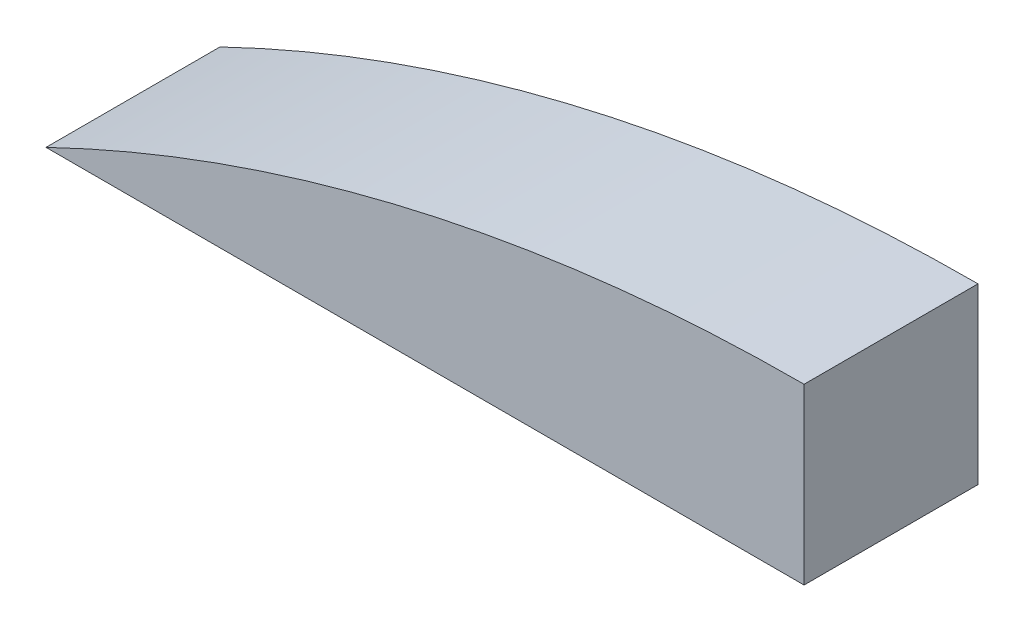
ISO-10303-21;
HEADER;
FILE_DESCRIPTION(('STEP AP214'),'2;1');
FILE_NAME('part.step','',(''),(''),'','','');
FILE_SCHEMA(('AUTOMOTIVE_DESIGN { 1 0 10303 214 1 1 1 1 }'));
ENDSEC;
DATA;
#1=APPLICATION_CONTEXT('core data for automotive mechanical design processes');
#2=APPLICATION_PROTOCOL_DEFINITION('international standard','automotive_design',2000,#1);
#3=PRODUCT_CONTEXT('',#1,'mechanical');
#4=PRODUCT('Part','Part','',(#3));
#5=PRODUCT_RELATED_PRODUCT_CATEGORY('part','',(#4));
#6=PRODUCT_DEFINITION_FORMATION('','',#4);
#7=PRODUCT_DEFINITION_CONTEXT('part definition',#1,'design');
#8=PRODUCT_DEFINITION('design','',#6,#7);
#9=PRODUCT_DEFINITION_SHAPE('','',#8);
#10=(LENGTH_UNIT() NAMED_UNIT(*) SI_UNIT(.MILLI.,.METRE.));
#11=(NAMED_UNIT(*) PLANE_ANGLE_UNIT() SI_UNIT($,.RADIAN.));
#12=(NAMED_UNIT(*) SI_UNIT($,.STERADIAN.) SOLID_ANGLE_UNIT());
#13=UNCERTAINTY_MEASURE_WITH_UNIT(LENGTH_MEASURE(1.E-05),#10,'distance_accuracy_value','');
#14=(GEOMETRIC_REPRESENTATION_CONTEXT(3) GLOBAL_UNCERTAINTY_ASSIGNED_CONTEXT((#13)) GLOBAL_UNIT_ASSIGNED_CONTEXT((#10,
#11,#12)) REPRESENTATION_CONTEXT('',''));
#15=CARTESIAN_POINT('',(0.,0.,0.));
#16=DIRECTION('',(0.,0.,1.));
#17=DIRECTION('',(1.,0.,0.));
#18=AXIS2_PLACEMENT_3D('',#15,#16,#17);
#19=CARTESIAN_POINT('',(0.,45.,0.));
#20=DIRECTION('',(0.,-1.,0.));
#21=DIRECTION('',(0.,0.,-1.));
#22=AXIS2_PLACEMENT_3D('',#19,#20,#21);
#23=PLANE('',#22);
#24=DIRECTION('',(1.,0.,0.));
#25=VECTOR('',#24,1.);
#26=CARTESIAN_POINT('',(597.266258042068,45.,5.));
#27=LINE('',#26,#25);
#28=CARTESIAN_POINT('',(-524.528236675635,45.,5.));
#29=VERTEX_POINT('',#28);
#30=CARTESIAN_POINT('',(-502.733741957931,45.,5.));
#31=VERTEX_POINT('',#30);
#32=EDGE_CURVE('E78',#29,#31,#27,.T.);
#33=ORIENTED_EDGE('',*,*,#32,.F.);
#34=DIRECTION('',(0.,0.,-1.));
#35=VECTOR('',#34,1.);
#36=CARTESIAN_POINT('',(-524.528236675635,45.,80.));
#37=LINE('',#36,#35);
#38=CARTESIAN_POINT('',(-524.528236675635,45.,0.));
#39=VERTEX_POINT('',#38);
#40=EDGE_CURVE('E37',#29,#39,#37,.T.);
#41=ORIENTED_EDGE('',*,*,#40,.T.);
#42=DIRECTION('',(1.,0.,0.));
#43=VECTOR('',#42,1.);
#44=CARTESIAN_POINT('',(-502.733741957931,45.,0.));
#45=LINE('',#44,#43);
#46=CARTESIAN_POINT('',(-502.733741957931,45.,0.));
#47=VERTEX_POINT('',#46);
#48=EDGE_CURVE('E88',#39,#47,#45,.T.);
#49=ORIENTED_EDGE('',*,*,#48,.T.);
#50=DIRECTION('',(0.,0.,1.));
#51=VECTOR('',#50,1.);
#52=CARTESIAN_POINT('',(-502.733741957931,45.,0.));
#53=LINE('',#52,#51);
#54=EDGE_CURVE('E11',#47,#31,#53,.T.);
#55=ORIENTED_EDGE('',*,*,#54,.T.);
#56=EDGE_LOOP('',(#33,#41,#49,#55));
#57=FACE_BOUND('',#56,.T.);
#58=ADVANCED_FACE('F34',(#57),#23,.T.);
#59=CARTESIAN_POINT('',(597.266258042068,-45.,5.));
#60=DIRECTION('',(0.,0.,1.));
#61=DIRECTION('',(1.,0.,0.));
#62=AXIS2_PLACEMENT_3D('',#59,#60,#61);
#63=PLANE('',#62);
#64=CARTESIAN_POINT('',(-502.733741957931,0.,5.));
#65=DIRECTION('',(0.,0.,1.));
#66=DIRECTION('',(1.,0.,0.));
#67=AXIS2_PLACEMENT_3D('',#64,#65,#66);
#68=CIRCLE('',#67,50.);
#69=CARTESIAN_POINT('',(-502.733741957931,50.,5.));
#70=VERTEX_POINT('',#69);
#71=EDGE_CURVE('E72',#70,#29,#68,.T.);
#72=ORIENTED_EDGE('',*,*,#71,.T.);
#73=ORIENTED_EDGE('',*,*,#32,.T.);
#74=DIRECTION('',(0.,1.,0.));
#75=VECTOR('',#74,1.);
#76=CARTESIAN_POINT('',(-502.733741957931,-45.,5.));
#77=LINE('',#76,#75);
#78=EDGE_CURVE('E57',#31,#70,#77,.T.);
#79=ORIENTED_EDGE('',*,*,#78,.T.);
#80=EDGE_LOOP('',(#72,#73,#79));
#81=FACE_BOUND('',#80,.T.);
#82=ADVANCED_FACE('F83',(#81),#63,.T.);
#83=CARTESIAN_POINT('',(-502.733741957931,0.,80.));
#84=DIRECTION('',(0.,0.,-1.));
#85=DIRECTION('',(-1.,0.,0.));
#86=AXIS2_PLACEMENT_3D('',#83,#84,#85);
#87=CYLINDRICAL_SURFACE('',#86,50.);
#88=ORIENTED_EDGE('',*,*,#40,.F.);
#89=ORIENTED_EDGE('',*,*,#71,.F.);
#90=DIRECTION('',(0.,0.,-1.));
#91=VECTOR('',#90,1.);
#92=CARTESIAN_POINT('',(-502.733741957931,50.,80.));
#93=LINE('',#92,#91);
#94=CARTESIAN_POINT('',(-502.733741957931,50.,0.));
#95=VERTEX_POINT('',#94);
#96=EDGE_CURVE('E74',#70,#95,#93,.T.);
#97=ORIENTED_EDGE('',*,*,#96,.T.);
#98=CARTESIAN_POINT('',(-502.733741957931,0.,0.));
#99=DIRECTION('',(0.,0.,1.));
#100=DIRECTION('',(1.,0.,0.));
#101=AXIS2_PLACEMENT_3D('',#98,#99,#100);
#102=CIRCLE('',#101,50.);
#103=EDGE_CURVE('E79',#95,#39,#102,.T.);
#104=ORIENTED_EDGE('',*,*,#103,.T.);
#105=EDGE_LOOP('',(#88,#89,#97,#104));
#106=FACE_BOUND('',#105,.T.);
#107=ADVANCED_FACE('F73',(#106),#87,.T.);
#108=CARTESIAN_POINT('',(-502.733741957931,0.,0.));
#109=DIRECTION('',(0.,0.,1.));
#110=DIRECTION('',(1.,0.,0.));
#111=AXIS2_PLACEMENT_3D('',#108,#109,#110);
#112=PLANE('',#111);
#113=ORIENTED_EDGE('',*,*,#48,.F.);
#114=ORIENTED_EDGE('',*,*,#103,.F.);
#115=DIRECTION('',(0.,1.,0.));
#116=VECTOR('',#115,1.);
#117=CARTESIAN_POINT('',(-502.733741957931,0.,0.));
#118=LINE('',#117,#116);
#119=EDGE_CURVE('E49',#47,#95,#118,.T.);
#120=ORIENTED_EDGE('',*,*,#119,.F.);
#121=EDGE_LOOP('',(#113,#114,#120));
#122=FACE_BOUND('',#121,.T.);
#123=ADVANCED_FACE('F95',(#122),#112,.F.);
#124=CARTESIAN_POINT('',(-502.733741957931,0.,0.));
#125=DIRECTION('',(1.,0.,0.));
#126=DIRECTION('',(0.,0.,-1.));
#127=AXIS2_PLACEMENT_3D('',#124,#125,#126);
#128=PLANE('',#127);
#129=ORIENTED_EDGE('',*,*,#54,.F.);
#130=ORIENTED_EDGE('',*,*,#119,.T.);
#131=ORIENTED_EDGE('',*,*,#96,.F.);
#132=ORIENTED_EDGE('',*,*,#78,.F.);
#133=EDGE_LOOP('',(#129,#130,#131,#132));
#134=FACE_BOUND('',#133,.T.);
#135=ADVANCED_FACE('F81',(#134),#128,.T.);
#136=CLOSED_SHELL('',(#58,#82,#107,#123,#135));
#137=MANIFOLD_SOLID_BREP('B2',#136);
#138=ADVANCED_BREP_SHAPE_REPRESENTATION('',(#18,#137),#14);
#139=SHAPE_DEFINITION_REPRESENTATION(#9,#138);
ENDSEC;
END-ISO-10303-21;
